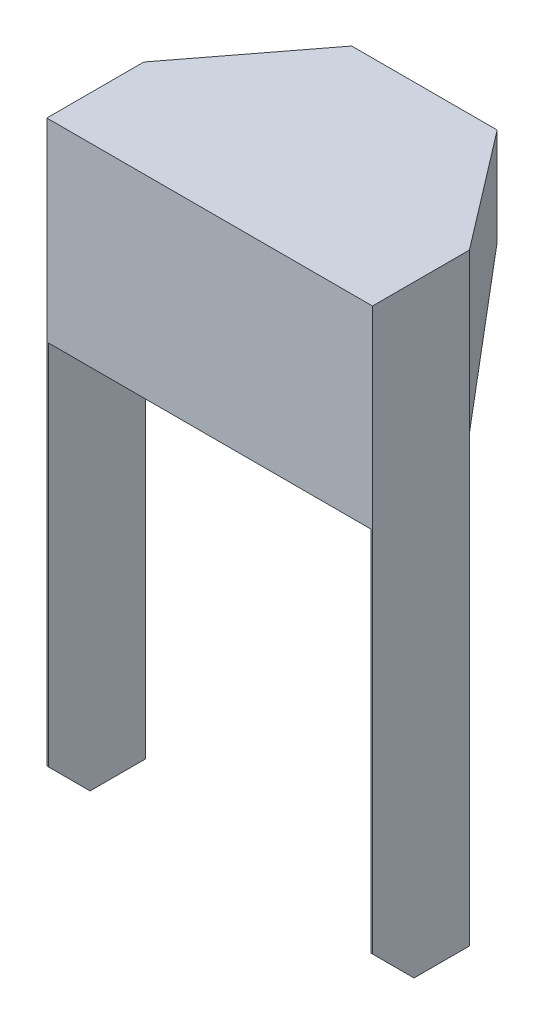
ISO-10303-21;
HEADER;
FILE_DESCRIPTION(('STEP AP214'),'2;1');
FILE_NAME('part.step','',(''),(''),'','','');
FILE_SCHEMA(('AUTOMOTIVE_DESIGN { 1 0 10303 214 1 1 1 1 }'));
ENDSEC;
DATA;
#1=APPLICATION_CONTEXT('core data for automotive mechanical design processes');
#2=APPLICATION_PROTOCOL_DEFINITION('international standard','automotive_design',2000,#1);
#3=PRODUCT_CONTEXT('',#1,'mechanical');
#4=PRODUCT('Part','Part','',(#3));
#5=PRODUCT_RELATED_PRODUCT_CATEGORY('part','',(#4));
#6=PRODUCT_DEFINITION_FORMATION('','',#4);
#7=PRODUCT_DEFINITION_CONTEXT('part definition',#1,'design');
#8=PRODUCT_DEFINITION('design','',#6,#7);
#9=PRODUCT_DEFINITION_SHAPE('','',#8);
#10=(LENGTH_UNIT() NAMED_UNIT(*) SI_UNIT(.MILLI.,.METRE.));
#11=(NAMED_UNIT(*) PLANE_ANGLE_UNIT() SI_UNIT($,.RADIAN.));
#12=(NAMED_UNIT(*) SI_UNIT($,.STERADIAN.) SOLID_ANGLE_UNIT());
#13=UNCERTAINTY_MEASURE_WITH_UNIT(LENGTH_MEASURE(1.E-05),#10,'distance_accuracy_value','');
#14=(GEOMETRIC_REPRESENTATION_CONTEXT(3) GLOBAL_UNCERTAINTY_ASSIGNED_CONTEXT((#13)) GLOBAL_UNIT_ASSIGNED_CONTEXT((#10,
#11,#12)) REPRESENTATION_CONTEXT('',''));
#15=CARTESIAN_POINT('',(0.,0.,0.));
#16=DIRECTION('',(0.,0.,1.));
#17=DIRECTION('',(1.,0.,0.));
#18=AXIS2_PLACEMENT_3D('',#15,#16,#17);
#19=CARTESIAN_POINT('',(0.,0.,0.));
#20=DIRECTION('',(0.,1.,0.));
#21=DIRECTION('',(0.,0.,1.));
#22=AXIS2_PLACEMENT_3D('',#19,#20,#21);
#23=PLANE('',#22);
#24=DIRECTION('',(1.,0.,0.));
#25=VECTOR('',#24,1.);
#26=CARTESIAN_POINT('',(0.,0.,-1.2));
#27=LINE('',#26,#25);
#28=CARTESIAN_POINT('',(-116.3,0.,-1.2));
#29=VERTEX_POINT('',#28);
#30=CARTESIAN_POINT('',(116.3,0.,-1.2));
#31=VERTEX_POINT('',#30);
#32=EDGE_CURVE('E277',#29,#31,#27,.T.);
#33=ORIENTED_EDGE('',*,*,#32,.F.);
#34=DIRECTION('',(0.,0.,1.));
#35=VECTOR('',#34,1.);
#36=CARTESIAN_POINT('',(-116.3,0.,0.));
#37=LINE('',#36,#35);
#38=CARTESIAN_POINT('',(-116.3,0.,-69.5937598868587));
#39=VERTEX_POINT('',#38);
#40=EDGE_CURVE('E355',#39,#29,#37,.T.);
#41=ORIENTED_EDGE('',*,*,#40,.F.);
#42=DIRECTION('',(-0.607450107570797,0.,0.794357832977196));
#43=VECTOR('',#42,1.);
#44=CARTESIAN_POINT('',(-106.967076277283,0.,-81.7983524473343));
#45=LINE('',#44,#43);
#46=CARTESIAN_POINT('',(-51.9069928546567,0.,-153.8));
#47=VERTEX_POINT('',#46);
#48=EDGE_CURVE('E308',#47,#39,#45,.T.);
#49=ORIENTED_EDGE('',*,*,#48,.F.);
#50=DIRECTION('',(-1.,0.,0.));
#51=VECTOR('',#50,1.);
#52=CARTESIAN_POINT('',(0.,0.,-153.8));
#53=LINE('',#52,#51);
#54=CARTESIAN_POINT('',(51.9069928546567,0.,-153.8));
#55=VERTEX_POINT('',#54);
#56=EDGE_CURVE('E292',#55,#47,#53,.T.);
#57=ORIENTED_EDGE('',*,*,#56,.F.);
#58=DIRECTION('',(0.607450107570797,0.,0.794357832977196));
#59=VECTOR('',#58,1.);
#60=CARTESIAN_POINT('',(106.967076277283,0.,-81.7983524473343));
#61=LINE('',#60,#59);
#62=CARTESIAN_POINT('',(116.3,0.,-69.5937598868587));
#63=VERTEX_POINT('',#62);
#64=EDGE_CURVE('E433',#55,#63,#61,.T.);
#65=ORIENTED_EDGE('',*,*,#64,.T.);
#66=DIRECTION('',(0.,0.,1.));
#67=VECTOR('',#66,1.);
#68=CARTESIAN_POINT('',(116.3,0.,0.));
#69=LINE('',#68,#67);
#70=EDGE_CURVE('E247',#63,#31,#69,.T.);
#71=ORIENTED_EDGE('',*,*,#70,.T.);
#72=EDGE_LOOP('',(#33,#41,#49,#57,#65,#71));
#73=FACE_BOUND('',#72,.T.);
#74=ADVANCED_FACE('F43',(#73),#23,.F.);
#75=CARTESIAN_POINT('',(-117.5,1.2,0.));
#76=DIRECTION('',(0.,0.,-1.));
#77=DIRECTION('',(-1.,0.,0.));
#78=AXIS2_PLACEMENT_3D('',#75,#76,#77);
#79=PLANE('',#78);
#80=DIRECTION('',(1.,0.,0.));
#81=VECTOR('',#80,1.);
#82=CARTESIAN_POINT('',(-117.5,-138.8,0.));
#83=LINE('',#82,#81);
#84=CARTESIAN_POINT('',(-116.3,-138.8,0.));
#85=VERTEX_POINT('',#84);
#86=CARTESIAN_POINT('',(116.3,-138.8,0.));
#87=VERTEX_POINT('',#86);
#88=EDGE_CURVE('E181',#85,#87,#83,.T.);
#89=ORIENTED_EDGE('',*,*,#88,.T.);
#90=DIRECTION('',(0.,1.,0.));
#91=VECTOR('',#90,1.);
#92=CARTESIAN_POINT('',(116.3,1.2,0.));
#93=LINE('',#92,#91);
#94=CARTESIAN_POINT('',(116.3,-403.8,0.));
#95=VERTEX_POINT('',#94);
#96=EDGE_CURVE('E186',#95,#87,#93,.T.);
#97=ORIENTED_EDGE('',*,*,#96,.F.);
#98=DIRECTION('',(-1.,0.,0.));
#99=VECTOR('',#98,1.);
#100=CARTESIAN_POINT('',(116.3,-403.8,0.));
#101=LINE('',#100,#99);
#102=CARTESIAN_POINT('',(117.5,-403.8,0.));
#103=VERTEX_POINT('',#102);
#104=EDGE_CURVE('E269',#103,#95,#101,.T.);
#105=ORIENTED_EDGE('',*,*,#104,.F.);
#106=DIRECTION('',(0.,-1.,0.));
#107=VECTOR('',#106,1.);
#108=CARTESIAN_POINT('',(117.5,1.2,0.));
#109=LINE('',#108,#107);
#110=CARTESIAN_POINT('',(117.5,1.2,0.));
#111=VERTEX_POINT('',#110);
#112=EDGE_CURVE('E235',#111,#103,#109,.T.);
#113=ORIENTED_EDGE('',*,*,#112,.F.);
#114=DIRECTION('',(1.,0.,0.));
#115=VECTOR('',#114,1.);
#116=CARTESIAN_POINT('',(-117.5,1.2,0.));
#117=LINE('',#116,#115);
#118=CARTESIAN_POINT('',(-117.5,1.2,0.));
#119=VERTEX_POINT('',#118);
#120=EDGE_CURVE('E335',#119,#111,#117,.T.);
#121=ORIENTED_EDGE('',*,*,#120,.F.);
#122=DIRECTION('',(0.,-1.,0.));
#123=VECTOR('',#122,1.);
#124=CARTESIAN_POINT('',(-117.5,1.2,0.));
#125=LINE('',#124,#123);
#126=CARTESIAN_POINT('',(-117.5,-403.8,0.));
#127=VERTEX_POINT('',#126);
#128=EDGE_CURVE('E65',#119,#127,#125,.T.);
#129=ORIENTED_EDGE('',*,*,#128,.T.);
#130=DIRECTION('',(1.,0.,0.));
#131=VECTOR('',#130,1.);
#132=CARTESIAN_POINT('',(-116.3,-403.8,0.));
#133=LINE('',#132,#131);
#134=CARTESIAN_POINT('',(-116.3,-403.8,0.));
#135=VERTEX_POINT('',#134);
#136=EDGE_CURVE('E60',#127,#135,#133,.T.);
#137=ORIENTED_EDGE('',*,*,#136,.T.);
#138=DIRECTION('',(0.,1.,0.));
#139=VECTOR('',#138,1.);
#140=CARTESIAN_POINT('',(-116.3,1.2,0.));
#141=LINE('',#140,#139);
#142=EDGE_CURVE('E187',#135,#85,#141,.T.);
#143=ORIENTED_EDGE('',*,*,#142,.T.);
#144=EDGE_LOOP('',(#89,#97,#105,#113,#121,#129,#137,#143));
#145=FACE_BOUND('',#144,.T.);
#146=ADVANCED_FACE('F183',(#145),#79,.F.);
#147=CARTESIAN_POINT('',(0.,1.2,-155.));
#148=DIRECTION('',(0.,0.,1.));
#149=DIRECTION('',(1.,0.,0.));
#150=AXIS2_PLACEMENT_3D('',#147,#148,#149);
#151=PLANE('',#150);
#152=DIRECTION('',(-1.,0.,0.));
#153=VECTOR('',#152,1.);
#154=CARTESIAN_POINT('',(0.,1.2,-155.));
#155=LINE('',#154,#153);
#156=CARTESIAN_POINT('',(52.5,1.2,-155.));
#157=VERTEX_POINT('',#156);
#158=CARTESIAN_POINT('',(-52.5,1.2,-155.));
#159=VERTEX_POINT('',#158);
#160=EDGE_CURVE('E338',#157,#159,#155,.T.);
#161=ORIENTED_EDGE('',*,*,#160,.F.);
#162=DIRECTION('',(0.,-1.,0.));
#163=VECTOR('',#162,1.);
#164=CARTESIAN_POINT('',(52.5,1.2,-155.));
#165=LINE('',#164,#163);
#166=CARTESIAN_POINT('',(52.5000000000001,-68.8,-155.));
#167=VERTEX_POINT('',#166);
#168=EDGE_CURVE('E243',#157,#167,#165,.T.);
#169=ORIENTED_EDGE('',*,*,#168,.T.);
#170=DIRECTION('',(-1.,0.,0.));
#171=VECTOR('',#170,1.);
#172=CARTESIAN_POINT('',(0.,-68.8,-155.));
#173=LINE('',#172,#171);
#174=CARTESIAN_POINT('',(-52.5000000000001,-68.8,-155.));
#175=VERTEX_POINT('',#174);
#176=EDGE_CURVE('E281',#167,#175,#173,.T.);
#177=ORIENTED_EDGE('',*,*,#176,.T.);
#178=DIRECTION('',(0.,-1.,0.));
#179=VECTOR('',#178,1.);
#180=CARTESIAN_POINT('',(-52.5,1.2,-155.));
#181=LINE('',#180,#179);
#182=EDGE_CURVE('E352',#159,#175,#181,.T.);
#183=ORIENTED_EDGE('',*,*,#182,.F.);
#184=EDGE_LOOP('',(#161,#169,#177,#183));
#185=FACE_BOUND('',#184,.T.);
#186=ADVANCED_FACE('F408',(#185),#151,.F.);
#187=CARTESIAN_POINT('',(-52.5,1.2,-155.));
#188=DIRECTION('',(0.794357832977196,0.,0.607450107570797));
#189=DIRECTION('',(0.607450107570797,0.,-0.794357832977196));
#190=AXIS2_PLACEMENT_3D('',#187,#188,#189);
#191=PLANE('',#190);
#192=ORIENTED_EDGE('',*,*,#182,.T.);
#193=DIRECTION('',(-0.561210721406439,-0.38268343236509,0.733890943377651));
#194=VECTOR('',#193,1.);
#195=CARTESIAN_POINT('',(-52.5000000000001,-68.8,-155.));
#196=LINE('',#195,#194);
#197=CARTESIAN_POINT('',(-117.5,-113.122786709052,-70.));
#198=VERTEX_POINT('',#197);
#199=EDGE_CURVE('E296',#175,#198,#196,.T.);
#200=ORIENTED_EDGE('',*,*,#199,.T.);
#201=DIRECTION('',(0.,-1.,0.));
#202=VECTOR('',#201,1.);
#203=CARTESIAN_POINT('',(-117.5,1.2,-70.));
#204=LINE('',#203,#202);
#205=CARTESIAN_POINT('',(-117.5,1.2,-70.));
#206=VERTEX_POINT('',#205);
#207=EDGE_CURVE('E349',#206,#198,#204,.T.);
#208=ORIENTED_EDGE('',*,*,#207,.F.);
#209=DIRECTION('',(-0.607450107570797,0.,0.794357832977196));
#210=VECTOR('',#209,1.);
#211=CARTESIAN_POINT('',(-52.5,1.2,-155.));
#212=LINE('',#211,#210);
#213=EDGE_CURVE('E341',#159,#206,#212,.T.);
#214=ORIENTED_EDGE('',*,*,#213,.F.);
#215=EDGE_LOOP('',(#192,#200,#208,#214));
#216=FACE_BOUND('',#215,.T.);
#217=ADVANCED_FACE('F471',(#216),#191,.F.);
#218=CARTESIAN_POINT('',(-117.5,1.2,-70.));
#219=DIRECTION('',(1.,0.,0.));
#220=DIRECTION('',(0.,0.,-1.));
#221=AXIS2_PLACEMENT_3D('',#218,#219,#220);
#222=PLANE('',#221);
#223=DIRECTION('',(0.,0.707106781186549,0.707106781186546));
#224=VECTOR('',#223,1.);
#225=CARTESIAN_POINT('',(-117.5,-433.8,-29.9999999999999));
#226=LINE('',#225,#224);
#227=CARTESIAN_POINT('',(-117.5,-433.8,-29.9999999999999));
#228=VERTEX_POINT('',#227);
#229=EDGE_CURVE('E374',#228,#127,#226,.T.);
#230=ORIENTED_EDGE('',*,*,#229,.T.);
#231=ORIENTED_EDGE('',*,*,#128,.F.);
#232=DIRECTION('',(0.,0.,1.));
#233=VECTOR('',#232,1.);
#234=CARTESIAN_POINT('',(-117.5,1.2,-70.));
#235=LINE('',#234,#233);
#236=EDGE_CURVE('E344',#206,#119,#235,.T.);
#237=ORIENTED_EDGE('',*,*,#236,.F.);
#238=ORIENTED_EDGE('',*,*,#207,.T.);
#239=DIRECTION('',(0.,-1.,0.));
#240=VECTOR('',#239,1.);
#241=CARTESIAN_POINT('',(-117.5,1.2,-70.));
#242=LINE('',#241,#240);
#243=CARTESIAN_POINT('',(-117.5,-433.8,-70.));
#244=VERTEX_POINT('',#243);
#245=EDGE_CURVE('E315',#198,#244,#242,.T.);
#246=ORIENTED_EDGE('',*,*,#245,.T.);
#247=DIRECTION('',(0.,0.,1.));
#248=VECTOR('',#247,1.);
#249=CARTESIAN_POINT('',(-117.5,-433.8,-70.));
#250=LINE('',#249,#248);
#251=EDGE_CURVE('E320',#244,#228,#250,.T.);
#252=ORIENTED_EDGE('',*,*,#251,.T.);
#253=EDGE_LOOP('',(#230,#231,#237,#238,#246,#252));
#254=FACE_BOUND('',#253,.T.);
#255=ADVANCED_FACE('F458',(#254),#222,.F.);
#256=CARTESIAN_POINT('',(0.,1.2,0.));
#257=DIRECTION('',(0.,1.,0.));
#258=DIRECTION('',(0.,0.,1.));
#259=AXIS2_PLACEMENT_3D('',#256,#257,#258);
#260=PLANE('',#259);
#261=ORIENTED_EDGE('',*,*,#120,.T.);
#262=DIRECTION('',(0.,0.,1.));
#263=VECTOR('',#262,1.);
#264=CARTESIAN_POINT('',(117.5,1.2,-70.));
#265=LINE('',#264,#263);
#266=CARTESIAN_POINT('',(117.5,1.2,-70.));
#267=VERTEX_POINT('',#266);
#268=EDGE_CURVE('E231',#267,#111,#265,.T.);
#269=ORIENTED_EDGE('',*,*,#268,.F.);
#270=DIRECTION('',(0.607450107570797,0.,0.794357832977196));
#271=VECTOR('',#270,1.);
#272=CARTESIAN_POINT('',(52.5,1.2,-155.));
#273=LINE('',#272,#271);
#274=EDGE_CURVE('E213',#157,#267,#273,.T.);
#275=ORIENTED_EDGE('',*,*,#274,.F.);
#276=ORIENTED_EDGE('',*,*,#160,.T.);
#277=ORIENTED_EDGE('',*,*,#213,.T.);
#278=ORIENTED_EDGE('',*,*,#236,.T.);
#279=EDGE_LOOP('',(#261,#269,#275,#276,#277,#278));
#280=FACE_BOUND('',#279,.T.);
#281=ADVANCED_FACE('F454',(#280),#260,.T.);
#282=CARTESIAN_POINT('',(-116.3,1.2,-70.));
#283=DIRECTION('',(0.,0.,-1.));
#284=DIRECTION('',(0.,1.,0.));
#285=AXIS2_PLACEMENT_3D('',#282,#283,#284);
#286=PLANE('',#285);
#287=DIRECTION('',(-0.969773079324329,-0.244008554394737,0.));
#288=VECTOR('',#287,1.);
#289=CARTESIAN_POINT('',(-89.3189125475623,-106.032028512988,-70.));
#290=LINE('',#289,#288);
#291=CARTESIAN_POINT('',(-116.3,-112.820849821427,-70.));
#292=VERTEX_POINT('',#291);
#293=EDGE_CURVE('E311',#292,#198,#290,.T.);
#294=ORIENTED_EDGE('',*,*,#293,.F.);
#295=DIRECTION('',(0.,-1.,0.));
#296=VECTOR('',#295,1.);
#297=CARTESIAN_POINT('',(-116.3,1.2,-70.));
#298=LINE('',#297,#296);
#299=CARTESIAN_POINT('',(-116.3,-433.8,-70.));
#300=VERTEX_POINT('',#299);
#301=EDGE_CURVE('E316',#292,#300,#298,.T.);
#302=ORIENTED_EDGE('',*,*,#301,.T.);
#303=DIRECTION('',(-1.,0.,0.));
#304=VECTOR('',#303,1.);
#305=CARTESIAN_POINT('',(-116.3,-433.8,-70.));
#306=LINE('',#305,#304);
#307=EDGE_CURVE('E326',#300,#244,#306,.T.);
#308=ORIENTED_EDGE('',*,*,#307,.T.);
#309=ORIENTED_EDGE('',*,*,#245,.F.);
#310=EDGE_LOOP('',(#294,#302,#308,#309));
#311=FACE_BOUND('',#310,.T.);
#312=ADVANCED_FACE('F469',(#311),#286,.T.);
#313=CARTESIAN_POINT('',(-116.3,0.,0.));
#314=DIRECTION('',(-1.,0.,0.));
#315=DIRECTION('',(0.,0.,1.));
#316=AXIS2_PLACEMENT_3D('',#313,#314,#315);
#317=PLANE('',#316);
#318=DIRECTION('',(0.,1.,0.));
#319=VECTOR('',#318,1.);
#320=CARTESIAN_POINT('',(-116.3,0.,-1.2));
#321=LINE('',#320,#319);
#322=CARTESIAN_POINT('',(-116.3,-138.8,-1.2));
#323=VERTEX_POINT('',#322);
#324=EDGE_CURVE('E53',#323,#29,#321,.T.);
#325=ORIENTED_EDGE('',*,*,#324,.F.);
#326=DIRECTION('',(0.,0.,1.));
#327=VECTOR('',#326,1.);
#328=CARTESIAN_POINT('',(-116.3,-138.8,0.));
#329=LINE('',#328,#327);
#330=EDGE_CURVE('E11',#323,#85,#329,.T.);
#331=ORIENTED_EDGE('',*,*,#330,.T.);
#332=ORIENTED_EDGE('',*,*,#142,.F.);
#333=DIRECTION('',(0.,-0.707106781186549,-0.707106781186546));
#334=VECTOR('',#333,1.);
#335=CARTESIAN_POINT('',(-116.3,-433.8,-29.9999999999999));
#336=LINE('',#335,#334);
#337=CARTESIAN_POINT('',(-116.3,-433.8,-29.9999999999999));
#338=VERTEX_POINT('',#337);
#339=EDGE_CURVE('E379',#135,#338,#336,.T.);
#340=ORIENTED_EDGE('',*,*,#339,.T.);
#341=DIRECTION('',(0.,0.,1.));
#342=VECTOR('',#341,1.);
#343=CARTESIAN_POINT('',(-116.3,-433.8,-70.));
#344=LINE('',#343,#342);
#345=EDGE_CURVE('E319',#300,#338,#344,.T.);
#346=ORIENTED_EDGE('',*,*,#345,.F.);
#347=ORIENTED_EDGE('',*,*,#301,.F.);
#348=DIRECTION('',(0.,-0.312549662397379,0.949901420430186));
#349=VECTOR('',#348,1.);
#350=CARTESIAN_POINT('',(-116.3,-122.582082360262,-40.3336468749742));
#351=LINE('',#350,#349);
#352=CARTESIAN_POINT('',(-116.3,-112.954516544609,-69.5937598868587));
#353=VERTEX_POINT('',#352);
#354=EDGE_CURVE('E363',#292,#353,#351,.T.);
#355=ORIENTED_EDGE('',*,*,#354,.T.);
#356=DIRECTION('',(0.,-1.,0.));
#357=VECTOR('',#356,1.);
#358=CARTESIAN_POINT('',(-116.3,0.,-69.5937598868587));
#359=LINE('',#358,#357);
#360=EDGE_CURVE('E359',#39,#353,#359,.T.);
#361=ORIENTED_EDGE('',*,*,#360,.F.);
#362=ORIENTED_EDGE('',*,*,#40,.T.);
#363=EDGE_LOOP('',(#325,#331,#332,#340,#346,#347,#355,#361,#362));
#364=FACE_BOUND('',#363,.T.);
#365=ADVANCED_FACE('F393',(#364),#317,.F.);
#366=CARTESIAN_POINT('',(-116.3,-433.8,-70.));
#367=DIRECTION('',(0.,-1.,0.));
#368=DIRECTION('',(0.,0.,-1.));
#369=AXIS2_PLACEMENT_3D('',#366,#367,#368);
#370=PLANE('',#369);
#371=ORIENTED_EDGE('',*,*,#345,.T.);
#372=DIRECTION('',(-1.,0.,0.));
#373=VECTOR('',#372,1.);
#374=CARTESIAN_POINT('',(-117.5,-433.8,-29.9999999999999));
#375=LINE('',#374,#373);
#376=EDGE_CURVE('E370',#338,#228,#375,.T.);
#377=ORIENTED_EDGE('',*,*,#376,.T.);
#378=ORIENTED_EDGE('',*,*,#251,.F.);
#379=ORIENTED_EDGE('',*,*,#307,.F.);
#380=EDGE_LOOP('',(#371,#377,#378,#379));
#381=FACE_BOUND('',#380,.T.);
#382=ADVANCED_FACE('F466',(#381),#370,.T.);
#383=CARTESIAN_POINT('',(-106.967076277283,0.,-81.7983524473343));
#384=DIRECTION('',(-0.794357832977196,0.,-0.607450107570797));
#385=DIRECTION('',(-0.607450107570797,0.,0.794357832977196));
#386=AXIS2_PLACEMENT_3D('',#383,#384,#385);
#387=PLANE('',#386);
#388=DIRECTION('',(-0.561210721406439,-0.38268343236509,0.733890943377651));
#389=VECTOR('',#388,1.);
#390=CARTESIAN_POINT('',(-51.5467706004275,-68.8,-154.271059870915));
#391=LINE('',#390,#389);
#392=CARTESIAN_POINT('',(-51.5467706004275,-68.8,-154.271059870915));
#393=VERTEX_POINT('',#392);
#394=EDGE_CURVE('E297',#393,#353,#391,.T.);
#395=ORIENTED_EDGE('',*,*,#394,.F.);
#396=DIRECTION('',(-0.607450107570797,0.,0.794357832977196));
#397=VECTOR('',#396,1.);
#398=CARTESIAN_POINT('',(-106.967076277283,-68.8,-81.7983524473343));
#399=LINE('',#398,#397);
#400=CARTESIAN_POINT('',(-51.9069928546567,-68.8,-153.8));
#401=VERTEX_POINT('',#400);
#402=EDGE_CURVE('E286',#393,#401,#399,.T.);
#403=ORIENTED_EDGE('',*,*,#402,.T.);
#404=DIRECTION('',(0.,-1.,0.));
#405=VECTOR('',#404,1.);
#406=CARTESIAN_POINT('',(-51.9069928546567,0.,-153.8));
#407=LINE('',#406,#405);
#408=EDGE_CURVE('E366',#47,#401,#407,.T.);
#409=ORIENTED_EDGE('',*,*,#408,.F.);
#410=ORIENTED_EDGE('',*,*,#48,.T.);
#411=ORIENTED_EDGE('',*,*,#360,.T.);
#412=EDGE_LOOP('',(#395,#403,#409,#410,#411));
#413=FACE_BOUND('',#412,.T.);
#414=ADVANCED_FACE('F398',(#413),#387,.F.);
#415=CARTESIAN_POINT('',(-51.5467706004275,-68.8,-154.271059870915));
#416=DIRECTION('',(0.232461092155736,-0.923879532511286,-0.303987582049809));
#417=DIRECTION('',(0.,0.312549662397379,-0.949901420430186));
#418=AXIS2_PLACEMENT_3D('',#415,#416,#417);
#419=PLANE('',#418);
#420=ORIENTED_EDGE('',*,*,#354,.F.);
#421=ORIENTED_EDGE('',*,*,#293,.T.);
#422=ORIENTED_EDGE('',*,*,#199,.F.);
#423=DIRECTION('',(-0.794357832977196,0.,-0.607450107570797));
#424=VECTOR('',#423,1.);
#425=CARTESIAN_POINT('',(-51.5467706004275,-68.8,-154.271059870915));
#426=LINE('',#425,#424);
#427=EDGE_CURVE('E301',#393,#175,#426,.T.);
#428=ORIENTED_EDGE('',*,*,#427,.F.);
#429=ORIENTED_EDGE('',*,*,#394,.T.);
#430=EDGE_LOOP('',(#420,#421,#422,#428,#429));
#431=FACE_BOUND('',#430,.T.);
#432=ADVANCED_FACE('F401',(#431),#419,.T.);
#433=CARTESIAN_POINT('',(0.,0.,-153.8));
#434=DIRECTION('',(0.,0.,-1.));
#435=DIRECTION('',(-1.,0.,0.));
#436=AXIS2_PLACEMENT_3D('',#433,#434,#435);
#437=PLANE('',#436);
#438=DIRECTION('',(-1.,0.,0.));
#439=VECTOR('',#438,1.);
#440=CARTESIAN_POINT('',(0.,-68.8,-153.8));
#441=LINE('',#440,#439);
#442=CARTESIAN_POINT('',(51.9069928546567,-68.8,-153.8));
#443=VERTEX_POINT('',#442);
#444=EDGE_CURVE('E282',#443,#401,#441,.T.);
#445=ORIENTED_EDGE('',*,*,#444,.F.);
#446=DIRECTION('',(0.,-1.,0.));
#447=VECTOR('',#446,1.);
#448=CARTESIAN_POINT('',(51.9069928546567,0.,-153.8));
#449=LINE('',#448,#447);
#450=EDGE_CURVE('E259',#55,#443,#449,.T.);
#451=ORIENTED_EDGE('',*,*,#450,.F.);
#452=ORIENTED_EDGE('',*,*,#56,.T.);
#453=ORIENTED_EDGE('',*,*,#408,.T.);
#454=EDGE_LOOP('',(#445,#451,#452,#453));
#455=FACE_BOUND('',#454,.T.);
#456=ADVANCED_FACE('F496',(#455),#437,.F.);
#457=CARTESIAN_POINT('',(0.,-68.8,-153.8));
#458=DIRECTION('',(0.,-1.,0.));
#459=DIRECTION('',(0.,0.,-1.));
#460=AXIS2_PLACEMENT_3D('',#457,#458,#459);
#461=PLANE('',#460);
#462=ORIENTED_EDGE('',*,*,#402,.F.);
#463=ORIENTED_EDGE('',*,*,#427,.T.);
#464=ORIENTED_EDGE('',*,*,#176,.F.);
#465=DIRECTION('',(0.794357832977196,0.,-0.607450107570797));
#466=VECTOR('',#465,1.);
#467=CARTESIAN_POINT('',(51.5467706004275,-68.8,-154.271059870915));
#468=LINE('',#467,#466);
#469=CARTESIAN_POINT('',(51.5467706004275,-68.8,-154.271059870915));
#470=VERTEX_POINT('',#469);
#471=EDGE_CURVE('E426',#470,#167,#468,.T.);
#472=ORIENTED_EDGE('',*,*,#471,.F.);
#473=DIRECTION('',(0.607450107570797,0.,0.794357832977196));
#474=VECTOR('',#473,1.);
#475=CARTESIAN_POINT('',(106.967076277283,-68.8,-81.7983524473343));
#476=LINE('',#475,#474);
#477=EDGE_CURVE('E422',#470,#443,#476,.T.);
#478=ORIENTED_EDGE('',*,*,#477,.T.);
#479=ORIENTED_EDGE('',*,*,#444,.T.);
#480=EDGE_LOOP('',(#462,#463,#464,#472,#478,#479));
#481=FACE_BOUND('',#480,.T.);
#482=ADVANCED_FACE('F404',(#481),#461,.T.);
#483=CARTESIAN_POINT('',(-116.3,-433.8,-29.9999999999999));
#484=DIRECTION('',(0.,-0.707106781186546,0.707106781186549));
#485=DIRECTION('',(1.,0.,0.));
#486=AXIS2_PLACEMENT_3D('',#483,#484,#485);
#487=PLANE('',#486);
#488=ORIENTED_EDGE('',*,*,#339,.F.);
#489=ORIENTED_EDGE('',*,*,#136,.F.);
#490=ORIENTED_EDGE('',*,*,#229,.F.);
#491=ORIENTED_EDGE('',*,*,#376,.F.);
#492=EDGE_LOOP('',(#488,#489,#490,#491));
#493=FACE_BOUND('',#492,.T.);
#494=ADVANCED_FACE('F46',(#493),#487,.T.);
#495=CARTESIAN_POINT('',(-117.5,-138.8,-1.2));
#496=DIRECTION('',(0.,-1.,0.));
#497=DIRECTION('',(0.,0.,-1.));
#498=AXIS2_PLACEMENT_3D('',#495,#496,#497);
#499=PLANE('',#498);
#500=ORIENTED_EDGE('',*,*,#330,.F.);
#501=DIRECTION('',(1.,0.,0.));
#502=VECTOR('',#501,1.);
#503=CARTESIAN_POINT('',(-117.5,-138.8,-1.2));
#504=LINE('',#503,#502);
#505=CARTESIAN_POINT('',(116.3,-138.8,-1.2));
#506=VERTEX_POINT('',#505);
#507=EDGE_CURVE('E190',#323,#506,#504,.T.);
#508=ORIENTED_EDGE('',*,*,#507,.T.);
#509=DIRECTION('',(0.,0.,1.));
#510=VECTOR('',#509,1.);
#511=CARTESIAN_POINT('',(116.3,-138.8,0.));
#512=LINE('',#511,#510);
#513=EDGE_CURVE('E191',#506,#87,#512,.T.);
#514=ORIENTED_EDGE('',*,*,#513,.T.);
#515=ORIENTED_EDGE('',*,*,#88,.F.);
#516=EDGE_LOOP('',(#500,#508,#514,#515));
#517=FACE_BOUND('',#516,.T.);
#518=ADVANCED_FACE('F194',(#517),#499,.T.);
#519=CARTESIAN_POINT('',(0.,0.,-1.2));
#520=DIRECTION('',(0.,0.,1.));
#521=DIRECTION('',(1.,0.,0.));
#522=AXIS2_PLACEMENT_3D('',#519,#520,#521);
#523=PLANE('',#522);
#524=ORIENTED_EDGE('',*,*,#324,.T.);
#525=ORIENTED_EDGE('',*,*,#32,.T.);
#526=DIRECTION('',(0.,1.,0.));
#527=VECTOR('',#526,1.);
#528=CARTESIAN_POINT('',(116.3,0.,-1.2));
#529=LINE('',#528,#527);
#530=EDGE_CURVE('E200',#506,#31,#529,.T.);
#531=ORIENTED_EDGE('',*,*,#530,.F.);
#532=ORIENTED_EDGE('',*,*,#507,.F.);
#533=EDGE_LOOP('',(#524,#525,#531,#532));
#534=FACE_BOUND('',#533,.T.);
#535=ADVANCED_FACE('F385',(#534),#523,.F.);
#536=CARTESIAN_POINT('',(52.5,1.2,-155.));
#537=DIRECTION('',(-0.794357832977196,0.,0.607450107570797));
#538=DIRECTION('',(-0.607450107570797,0.,-0.794357832977196));
#539=AXIS2_PLACEMENT_3D('',#536,#537,#538);
#540=PLANE('',#539);
#541=ORIENTED_EDGE('',*,*,#168,.F.);
#542=ORIENTED_EDGE('',*,*,#274,.T.);
#543=DIRECTION('',(0.,-1.,0.));
#544=VECTOR('',#543,1.);
#545=CARTESIAN_POINT('',(117.5,1.2,-70.));
#546=LINE('',#545,#544);
#547=CARTESIAN_POINT('',(117.5,-113.122786709052,-70.));
#548=VERTEX_POINT('',#547);
#549=EDGE_CURVE('E239',#267,#548,#546,.T.);
#550=ORIENTED_EDGE('',*,*,#549,.T.);
#551=DIRECTION('',(0.561210721406439,-0.38268343236509,0.733890943377651));
#552=VECTOR('',#551,1.);
#553=CARTESIAN_POINT('',(52.5000000000001,-68.8,-155.));
#554=LINE('',#553,#552);
#555=EDGE_CURVE('E416',#167,#548,#554,.T.);
#556=ORIENTED_EDGE('',*,*,#555,.F.);
#557=EDGE_LOOP('',(#541,#542,#550,#556));
#558=FACE_BOUND('',#557,.T.);
#559=ADVANCED_FACE('F414',(#558),#540,.F.);
#560=CARTESIAN_POINT('',(117.5,1.2,-70.));
#561=DIRECTION('',(-1.,0.,0.));
#562=DIRECTION('',(0.,0.,-1.));
#563=AXIS2_PLACEMENT_3D('',#560,#561,#562);
#564=PLANE('',#563);
#565=DIRECTION('',(0.,0.707106781186549,0.707106781186546));
#566=VECTOR('',#565,1.);
#567=CARTESIAN_POINT('',(117.5,-433.8,-29.9999999999999));
#568=LINE('',#567,#566);
#569=CARTESIAN_POINT('',(117.5,-433.8,-29.9999999999999));
#570=VERTEX_POINT('',#569);
#571=EDGE_CURVE('E266',#570,#103,#568,.T.);
#572=ORIENTED_EDGE('',*,*,#571,.F.);
#573=DIRECTION('',(0.,0.,1.));
#574=VECTOR('',#573,1.);
#575=CARTESIAN_POINT('',(117.5,-433.8,-70.));
#576=LINE('',#575,#574);
#577=CARTESIAN_POINT('',(117.5,-433.8,-70.));
#578=VERTEX_POINT('',#577);
#579=EDGE_CURVE('E223',#578,#570,#576,.T.);
#580=ORIENTED_EDGE('',*,*,#579,.F.);
#581=DIRECTION('',(0.,-1.,0.));
#582=VECTOR('',#581,1.);
#583=CARTESIAN_POINT('',(117.5,1.2,-70.));
#584=LINE('',#583,#582);
#585=EDGE_CURVE('E219',#548,#578,#584,.T.);
#586=ORIENTED_EDGE('',*,*,#585,.F.);
#587=ORIENTED_EDGE('',*,*,#549,.F.);
#588=ORIENTED_EDGE('',*,*,#268,.T.);
#589=ORIENTED_EDGE('',*,*,#112,.T.);
#590=EDGE_LOOP('',(#572,#580,#586,#587,#588,#589));
#591=FACE_BOUND('',#590,.T.);
#592=ADVANCED_FACE('F452',(#591),#564,.F.);
#593=CARTESIAN_POINT('',(116.3,1.2,-70.));
#594=DIRECTION('',(0.,0.,-1.));
#595=DIRECTION('',(0.,1.,0.));
#596=AXIS2_PLACEMENT_3D('',#593,#594,#595);
#597=PLANE('',#596);
#598=DIRECTION('',(0.969773079324329,-0.244008554394737,0.));
#599=VECTOR('',#598,1.);
#600=CARTESIAN_POINT('',(89.3189125475623,-106.032028512988,-70.));
#601=LINE('',#600,#599);
#602=CARTESIAN_POINT('',(116.3,-112.820849821427,-70.));
#603=VERTEX_POINT('',#602);
#604=EDGE_CURVE('E224',#603,#548,#601,.T.);
#605=ORIENTED_EDGE('',*,*,#604,.T.);
#606=ORIENTED_EDGE('',*,*,#585,.T.);
#607=DIRECTION('',(1.,0.,0.));
#608=VECTOR('',#607,1.);
#609=CARTESIAN_POINT('',(116.3,-433.8,-70.));
#610=LINE('',#609,#608);
#611=CARTESIAN_POINT('',(116.3,-433.8,-70.));
#612=VERTEX_POINT('',#611);
#613=EDGE_CURVE('E208',#612,#578,#610,.T.);
#614=ORIENTED_EDGE('',*,*,#613,.F.);
#615=DIRECTION('',(0.,-1.,0.));
#616=VECTOR('',#615,1.);
#617=CARTESIAN_POINT('',(116.3,1.2,-70.));
#618=LINE('',#617,#616);
#619=EDGE_CURVE('E215',#603,#612,#618,.T.);
#620=ORIENTED_EDGE('',*,*,#619,.F.);
#621=EDGE_LOOP('',(#605,#606,#614,#620));
#622=FACE_BOUND('',#621,.T.);
#623=ADVANCED_FACE('F442',(#622),#597,.T.);
#624=CARTESIAN_POINT('',(116.3,0.,0.));
#625=DIRECTION('',(1.,0.,0.));
#626=DIRECTION('',(0.,0.,1.));
#627=AXIS2_PLACEMENT_3D('',#624,#625,#626);
#628=PLANE('',#627);
#629=ORIENTED_EDGE('',*,*,#530,.T.);
#630=ORIENTED_EDGE('',*,*,#70,.F.);
#631=DIRECTION('',(0.,-1.,0.));
#632=VECTOR('',#631,1.);
#633=CARTESIAN_POINT('',(116.3,0.,-69.5937598868587));
#634=LINE('',#633,#632);
#635=CARTESIAN_POINT('',(116.3,-112.954516544609,-69.5937598868587));
#636=VERTEX_POINT('',#635);
#637=EDGE_CURVE('E251',#63,#636,#634,.T.);
#638=ORIENTED_EDGE('',*,*,#637,.T.);
#639=DIRECTION('',(0.,-0.312549662397379,0.949901420430186));
#640=VECTOR('',#639,1.);
#641=CARTESIAN_POINT('',(116.3,-122.582082360262,-40.3336468749742));
#642=LINE('',#641,#640);
#643=EDGE_CURVE('E255',#603,#636,#642,.T.);
#644=ORIENTED_EDGE('',*,*,#643,.F.);
#645=ORIENTED_EDGE('',*,*,#619,.T.);
#646=DIRECTION('',(0.,0.,1.));
#647=VECTOR('',#646,1.);
#648=CARTESIAN_POINT('',(116.3,-433.8,-70.));
#649=LINE('',#648,#647);
#650=CARTESIAN_POINT('',(116.3,-433.8,-29.9999999999999));
#651=VERTEX_POINT('',#650);
#652=EDGE_CURVE('E209',#612,#651,#649,.T.);
#653=ORIENTED_EDGE('',*,*,#652,.T.);
#654=DIRECTION('',(0.,-0.707106781186549,-0.707106781186546));
#655=VECTOR('',#654,1.);
#656=CARTESIAN_POINT('',(116.3,-433.8,-29.9999999999999));
#657=LINE('',#656,#655);
#658=EDGE_CURVE('E205',#95,#651,#657,.T.);
#659=ORIENTED_EDGE('',*,*,#658,.F.);
#660=ORIENTED_EDGE('',*,*,#96,.T.);
#661=ORIENTED_EDGE('',*,*,#513,.F.);
#662=EDGE_LOOP('',(#629,#630,#638,#644,#645,#653,#659,#660,#661));
#663=FACE_BOUND('',#662,.T.);
#664=ADVANCED_FACE('F202',(#663),#628,.F.);
#665=CARTESIAN_POINT('',(116.3,-433.8,-70.));
#666=DIRECTION('',(0.,-1.,0.));
#667=DIRECTION('',(0.,0.,-1.));
#668=AXIS2_PLACEMENT_3D('',#665,#666,#667);
#669=PLANE('',#668);
#670=ORIENTED_EDGE('',*,*,#652,.F.);
#671=ORIENTED_EDGE('',*,*,#613,.T.);
#672=ORIENTED_EDGE('',*,*,#579,.T.);
#673=DIRECTION('',(1.,0.,0.));
#674=VECTOR('',#673,1.);
#675=CARTESIAN_POINT('',(117.5,-433.8,-29.9999999999999));
#676=LINE('',#675,#674);
#677=EDGE_CURVE('E263',#651,#570,#676,.T.);
#678=ORIENTED_EDGE('',*,*,#677,.F.);
#679=EDGE_LOOP('',(#670,#671,#672,#678));
#680=FACE_BOUND('',#679,.T.);
#681=ADVANCED_FACE('F446',(#680),#669,.T.);
#682=CARTESIAN_POINT('',(106.967076277283,0.,-81.7983524473343));
#683=DIRECTION('',(0.794357832977196,0.,-0.607450107570797));
#684=DIRECTION('',(0.607450107570797,0.,0.794357832977196));
#685=AXIS2_PLACEMENT_3D('',#682,#683,#684);
#686=PLANE('',#685);
#687=DIRECTION('',(0.561210721406439,-0.38268343236509,0.733890943377651));
#688=VECTOR('',#687,1.);
#689=CARTESIAN_POINT('',(51.5467706004275,-68.8,-154.271059870915));
#690=LINE('',#689,#688);
#691=EDGE_CURVE('E421',#470,#636,#690,.T.);
#692=ORIENTED_EDGE('',*,*,#691,.T.);
#693=ORIENTED_EDGE('',*,*,#637,.F.);
#694=ORIENTED_EDGE('',*,*,#64,.F.);
#695=ORIENTED_EDGE('',*,*,#450,.T.);
#696=ORIENTED_EDGE('',*,*,#477,.F.);
#697=EDGE_LOOP('',(#692,#693,#694,#695,#696));
#698=FACE_BOUND('',#697,.T.);
#699=ADVANCED_FACE('F519',(#698),#686,.F.);
#700=CARTESIAN_POINT('',(51.5467706004275,-68.8,-154.271059870915));
#701=DIRECTION('',(-0.232461092155736,-0.923879532511286,-0.303987582049809));
#702=DIRECTION('',(0.,0.312549662397379,-0.949901420430186));
#703=AXIS2_PLACEMENT_3D('',#700,#701,#702);
#704=PLANE('',#703);
#705=ORIENTED_EDGE('',*,*,#643,.T.);
#706=ORIENTED_EDGE('',*,*,#691,.F.);
#707=ORIENTED_EDGE('',*,*,#471,.T.);
#708=ORIENTED_EDGE('',*,*,#555,.T.);
#709=ORIENTED_EDGE('',*,*,#604,.F.);
#710=EDGE_LOOP('',(#705,#706,#707,#708,#709));
#711=FACE_BOUND('',#710,.T.);
#712=ADVANCED_FACE('F510',(#711),#704,.T.);
#713=CARTESIAN_POINT('',(116.3,-433.8,-29.9999999999999));
#714=DIRECTION('',(0.,-0.707106781186546,0.707106781186549));
#715=DIRECTION('',(-1.,0.,0.));
#716=AXIS2_PLACEMENT_3D('',#713,#714,#715);
#717=PLANE('',#716);
#718=ORIENTED_EDGE('',*,*,#658,.T.);
#719=ORIENTED_EDGE('',*,*,#677,.T.);
#720=ORIENTED_EDGE('',*,*,#571,.T.);
#721=ORIENTED_EDGE('',*,*,#104,.T.);
#722=EDGE_LOOP('',(#718,#719,#720,#721));
#723=FACE_BOUND('',#722,.T.);
#724=ADVANCED_FACE('F449',(#723),#717,.T.);
#725=CLOSED_SHELL('',(#74,#146,#186,#217,#255,#281,#312,#365,#382,#414,#432,#456,#482,#494,#518,
#535,#559,#592,#623,#664,#681,#699,#712,#724));
#726=MANIFOLD_SOLID_BREP('B2',#725);
#727=ADVANCED_BREP_SHAPE_REPRESENTATION('',(#18,#726),#14);
#728=SHAPE_DEFINITION_REPRESENTATION(#9,#727);
ENDSEC;
END-ISO-10303-21;
